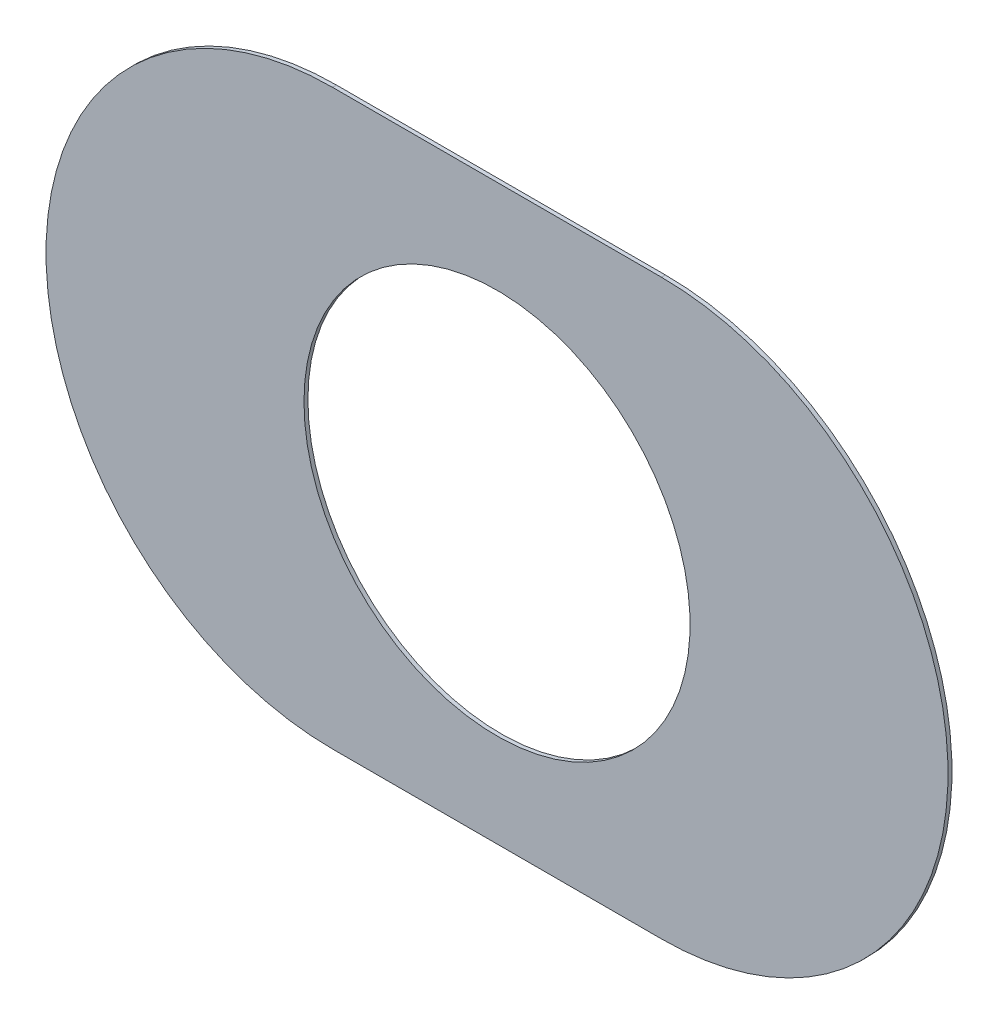
ISO-10303-21;
HEADER;
FILE_DESCRIPTION(('STEP AP214'),'2;1');
FILE_NAME('part.step','',(''),(''),'','','');
FILE_SCHEMA(('AUTOMOTIVE_DESIGN { 1 0 10303 214 1 1 1 1 }'));
ENDSEC;
DATA;
#1=APPLICATION_CONTEXT('core data for automotive mechanical design processes');
#2=APPLICATION_PROTOCOL_DEFINITION('international standard','automotive_design',2000,#1);
#3=PRODUCT_CONTEXT('',#1,'mechanical');
#4=PRODUCT('Part','Part','',(#3));
#5=PRODUCT_RELATED_PRODUCT_CATEGORY('part','',(#4));
#6=PRODUCT_DEFINITION_FORMATION('','',#4);
#7=PRODUCT_DEFINITION_CONTEXT('part definition',#1,'design');
#8=PRODUCT_DEFINITION('design','',#6,#7);
#9=PRODUCT_DEFINITION_SHAPE('','',#8);
#10=(LENGTH_UNIT() NAMED_UNIT(*) SI_UNIT(.MILLI.,.METRE.));
#11=(NAMED_UNIT(*) PLANE_ANGLE_UNIT() SI_UNIT($,.RADIAN.));
#12=(NAMED_UNIT(*) SI_UNIT($,.STERADIAN.) SOLID_ANGLE_UNIT());
#13=UNCERTAINTY_MEASURE_WITH_UNIT(LENGTH_MEASURE(1.E-05),#10,'distance_accuracy_value','');
#14=(GEOMETRIC_REPRESENTATION_CONTEXT(3) GLOBAL_UNCERTAINTY_ASSIGNED_CONTEXT((#13)) GLOBAL_UNIT_ASSIGNED_CONTEXT((#10,
#11,#12)) REPRESENTATION_CONTEXT('',''));
#15=CARTESIAN_POINT('',(0.,0.,0.));
#16=DIRECTION('',(0.,0.,1.));
#17=DIRECTION('',(1.,0.,0.));
#18=AXIS2_PLACEMENT_3D('',#15,#16,#17);
#19=CARTESIAN_POINT('',(1.54999965727325,12.0000006854535,0.));
#20=DIRECTION('',(0.,0.,-1.));
#21=DIRECTION('',(0.,-1.,0.));
#22=AXIS2_PLACEMENT_3D('',#19,#20,#21);
#23=PLANE('',#22);
#24=CARTESIAN_POINT('',(1.54999965727325,12.0000006854535,0.));
#25=DIRECTION('',(0.,0.,1.));
#26=DIRECTION('',(1.,0.,0.));
#27=AXIS2_PLACEMENT_3D('',#24,#25,#26);
#28=CIRCLE('',#27,0.49);
#29=CARTESIAN_POINT('',(1.05999965727325,12.0000006854535,0.));
#30=VERTEX_POINT('',#29);
#31=EDGE_CURVE('E110',#30,#30,#28,.T.);
#32=ORIENTED_EDGE('',*,*,#31,.F.);
#33=EDGE_LOOP('',(#32));
#34=FACE_BOUND('',#33,.T.);
#35=CARTESIAN_POINT('',(1.96740611181985,12.0000006854535,0.));
#36=DIRECTION('',(0.,0.,-1.));
#37=DIRECTION('',(0.,1.,0.));
#38=AXIS2_PLACEMENT_3D('',#35,#36,#37);
#39=CIRCLE('',#38,0.727257121659981);
#40=CARTESIAN_POINT('',(1.96740611181985,12.7272578071135,0.));
#41=VERTEX_POINT('',#40);
#42=CARTESIAN_POINT('',(1.96740611181985,11.2727435637935,0.));
#43=VERTEX_POINT('',#42);
#44=EDGE_CURVE('E27',#41,#43,#39,.T.);
#45=ORIENTED_EDGE('',*,*,#44,.F.);
#46=DIRECTION('',(1.,0.,0.));
#47=VECTOR('',#46,1.);
#48=CARTESIAN_POINT('',(1.13259320272665,12.7272578071135,0.));
#49=LINE('',#48,#47);
#50=CARTESIAN_POINT('',(1.13259320272665,12.7272578071135,0.));
#51=VERTEX_POINT('',#50);
#52=EDGE_CURVE('E113',#51,#41,#49,.T.);
#53=ORIENTED_EDGE('',*,*,#52,.F.);
#54=CARTESIAN_POINT('',(1.13259320272665,12.0000006854535,0.));
#55=DIRECTION('',(0.,0.,-1.));
#56=DIRECTION('',(0.,-1.,0.));
#57=AXIS2_PLACEMENT_3D('',#54,#55,#56);
#58=CIRCLE('',#57,0.727257121659981);
#59=CARTESIAN_POINT('',(1.13259320272665,11.2727435637935,0.));
#60=VERTEX_POINT('',#59);
#61=EDGE_CURVE('E71',#60,#51,#58,.T.);
#62=ORIENTED_EDGE('',*,*,#61,.F.);
#63=DIRECTION('',(-1.,0.,0.));
#64=VECTOR('',#63,1.);
#65=CARTESIAN_POINT('',(1.96740611181985,11.2727435637935,0.));
#66=LINE('',#65,#64);
#67=EDGE_CURVE('E84',#43,#60,#66,.T.);
#68=ORIENTED_EDGE('',*,*,#67,.F.);
#69=EDGE_LOOP('',(#45,#53,#62,#68));
#70=FACE_BOUND('',#69,.T.);
#71=ADVANCED_FACE('F17',(#34,#70),#23,.F.);
#72=CARTESIAN_POINT('',(1.54999965727325,12.0000006854535,-0.01));
#73=DIRECTION('',(0.,0.,-1.));
#74=DIRECTION('',(0.,-1.,0.));
#75=AXIS2_PLACEMENT_3D('',#72,#73,#74);
#76=PLANE('',#75);
#77=CARTESIAN_POINT('',(1.54999965727325,12.0000006854535,-0.01));
#78=DIRECTION('',(0.,0.,1.));
#79=DIRECTION('',(1.,0.,0.));
#80=AXIS2_PLACEMENT_3D('',#77,#78,#79);
#81=CIRCLE('',#80,0.49);
#82=CARTESIAN_POINT('',(1.05999965727325,12.0000006854535,-0.01));
#83=VERTEX_POINT('',#82);
#84=EDGE_CURVE('E126',#83,#83,#81,.T.);
#85=ORIENTED_EDGE('',*,*,#84,.T.);
#86=EDGE_LOOP('',(#85));
#87=FACE_BOUND('',#86,.T.);
#88=CARTESIAN_POINT('',(1.96740611181985,12.0000006854535,-0.01));
#89=DIRECTION('',(0.,0.,-1.));
#90=DIRECTION('',(0.,1.,0.));
#91=AXIS2_PLACEMENT_3D('',#88,#89,#90);
#92=CIRCLE('',#91,0.727257121659981);
#93=CARTESIAN_POINT('',(1.96740611181985,12.7272578071135,-0.01));
#94=VERTEX_POINT('',#93);
#95=CARTESIAN_POINT('',(1.96740611181985,11.2727435637935,-0.01));
#96=VERTEX_POINT('',#95);
#97=EDGE_CURVE('E11',#94,#96,#92,.T.);
#98=ORIENTED_EDGE('',*,*,#97,.T.);
#99=DIRECTION('',(-1.,0.,0.));
#100=VECTOR('',#99,1.);
#101=CARTESIAN_POINT('',(1.96740611181985,11.2727435637935,-0.01));
#102=LINE('',#101,#100);
#103=CARTESIAN_POINT('',(1.13259320272665,11.2727435637935,-0.01));
#104=VERTEX_POINT('',#103);
#105=EDGE_CURVE('E87',#96,#104,#102,.T.);
#106=ORIENTED_EDGE('',*,*,#105,.T.);
#107=CARTESIAN_POINT('',(1.13259320272665,12.0000006854535,-0.01));
#108=DIRECTION('',(0.,0.,-1.));
#109=DIRECTION('',(0.,-1.,0.));
#110=AXIS2_PLACEMENT_3D('',#107,#108,#109);
#111=CIRCLE('',#110,0.727257121659981);
#112=CARTESIAN_POINT('',(1.13259320272665,12.7272578071135,-0.01));
#113=VERTEX_POINT('',#112);
#114=EDGE_CURVE('E90',#104,#113,#111,.T.);
#115=ORIENTED_EDGE('',*,*,#114,.T.);
#116=DIRECTION('',(1.,0.,0.));
#117=VECTOR('',#116,1.);
#118=CARTESIAN_POINT('',(1.13259320272665,12.7272578071135,-0.01));
#119=LINE('',#118,#117);
#120=EDGE_CURVE('E114',#113,#94,#119,.T.);
#121=ORIENTED_EDGE('',*,*,#120,.T.);
#122=EDGE_LOOP('',(#98,#106,#115,#121));
#123=FACE_BOUND('',#122,.T.);
#124=ADVANCED_FACE('F88',(#87,#123),#76,.T.);
#125=CARTESIAN_POINT('',(1.96740611181985,12.0000006854535,0.));
#126=DIRECTION('',(0.,0.,-1.));
#127=DIRECTION('',(0.,1.,0.));
#128=AXIS2_PLACEMENT_3D('',#125,#126,#127);
#129=CYLINDRICAL_SURFACE('',#128,0.727257121659981);
#130=ORIENTED_EDGE('',*,*,#44,.T.);
#131=DIRECTION('',(0.,0.,-1.));
#132=VECTOR('',#131,1.);
#133=CARTESIAN_POINT('',(1.96740611181985,11.2727435637935,0.));
#134=LINE('',#133,#132);
#135=EDGE_CURVE('E92',#43,#96,#134,.T.);
#136=ORIENTED_EDGE('',*,*,#135,.T.);
#137=ORIENTED_EDGE('',*,*,#97,.F.);
#138=DIRECTION('',(0.,0.,-1.));
#139=VECTOR('',#138,1.);
#140=CARTESIAN_POINT('',(1.96740611181985,12.7272578071135,0.));
#141=LINE('',#140,#139);
#142=EDGE_CURVE('E116',#41,#94,#141,.T.);
#143=ORIENTED_EDGE('',*,*,#142,.F.);
#144=EDGE_LOOP('',(#130,#136,#137,#143));
#145=FACE_BOUND('',#144,.T.);
#146=ADVANCED_FACE('F152',(#145),#129,.T.);
#147=CARTESIAN_POINT('',(1.96740611181985,11.2727435637935,0.));
#148=DIRECTION('',(0.,-1.,0.));
#149=DIRECTION('',(0.,0.,-1.));
#150=AXIS2_PLACEMENT_3D('',#147,#148,#149);
#151=PLANE('',#150);
#152=ORIENTED_EDGE('',*,*,#67,.T.);
#153=DIRECTION('',(0.,0.,-1.));
#154=VECTOR('',#153,1.);
#155=CARTESIAN_POINT('',(1.13259320272665,11.2727435637935,0.));
#156=LINE('',#155,#154);
#157=EDGE_CURVE('E94',#60,#104,#156,.T.);
#158=ORIENTED_EDGE('',*,*,#157,.T.);
#159=ORIENTED_EDGE('',*,*,#105,.F.);
#160=ORIENTED_EDGE('',*,*,#135,.F.);
#161=EDGE_LOOP('',(#152,#158,#159,#160));
#162=FACE_BOUND('',#161,.T.);
#163=ADVANCED_FACE('F95',(#162),#151,.T.);
#164=CARTESIAN_POINT('',(1.13259320272665,12.0000006854535,0.));
#165=DIRECTION('',(0.,0.,-1.));
#166=DIRECTION('',(0.,-1.,0.));
#167=AXIS2_PLACEMENT_3D('',#164,#165,#166);
#168=CYLINDRICAL_SURFACE('',#167,0.727257121659981);
#169=ORIENTED_EDGE('',*,*,#61,.T.);
#170=DIRECTION('',(0.,0.,-1.));
#171=VECTOR('',#170,1.);
#172=CARTESIAN_POINT('',(1.13259320272665,12.7272578071135,0.));
#173=LINE('',#172,#171);
#174=EDGE_CURVE('E99',#51,#113,#173,.T.);
#175=ORIENTED_EDGE('',*,*,#174,.T.);
#176=ORIENTED_EDGE('',*,*,#114,.F.);
#177=ORIENTED_EDGE('',*,*,#157,.F.);
#178=EDGE_LOOP('',(#169,#175,#176,#177));
#179=FACE_BOUND('',#178,.T.);
#180=ADVANCED_FACE('F98',(#179),#168,.T.);
#181=CARTESIAN_POINT('',(1.13259320272665,12.7272578071135,0.));
#182=DIRECTION('',(0.,1.,0.));
#183=DIRECTION('',(1.,0.,0.));
#184=AXIS2_PLACEMENT_3D('',#181,#182,#183);
#185=PLANE('',#184);
#186=ORIENTED_EDGE('',*,*,#52,.T.);
#187=ORIENTED_EDGE('',*,*,#142,.T.);
#188=ORIENTED_EDGE('',*,*,#120,.F.);
#189=ORIENTED_EDGE('',*,*,#174,.F.);
#190=EDGE_LOOP('',(#186,#187,#188,#189));
#191=FACE_BOUND('',#190,.T.);
#192=ADVANCED_FACE('F131',(#191),#185,.T.);
#193=CARTESIAN_POINT('',(1.54999965727325,12.0000006854535,0.));
#194=DIRECTION('',(0.,0.,-1.));
#195=DIRECTION('',(1.,0.,0.));
#196=AXIS2_PLACEMENT_3D('',#193,#194,#195);
#197=CYLINDRICAL_SURFACE('',#196,0.49);
#198=ORIENTED_EDGE('',*,*,#84,.F.);
#199=DIRECTION('',(0.,0.,1.));
#200=VECTOR('',#199,1.);
#201=CARTESIAN_POINT('',(1.05999965727325,12.0000006854535,0.));
#202=LINE('',#201,#200);
#203=EDGE_CURVE('E20',#83,#30,#202,.T.);
#204=ORIENTED_EDGE('',*,*,#203,.T.);
#205=ORIENTED_EDGE('',*,*,#31,.T.);
#206=ORIENTED_EDGE('',*,*,#203,.F.);
#207=EDGE_LOOP('',(#198,#204,#205,#206));
#208=FACE_BOUND('',#207,.T.);
#209=ADVANCED_FACE('F142',(#208),#197,.F.);
#210=CLOSED_SHELL('',(#71,#124,#146,#163,#180,#192,#209));
#211=MANIFOLD_SOLID_BREP('B1',#210);
#212=ADVANCED_BREP_SHAPE_REPRESENTATION('',(#18,#211),#14);
#213=SHAPE_DEFINITION_REPRESENTATION(#9,#212);
ENDSEC;
END-ISO-10303-21;
